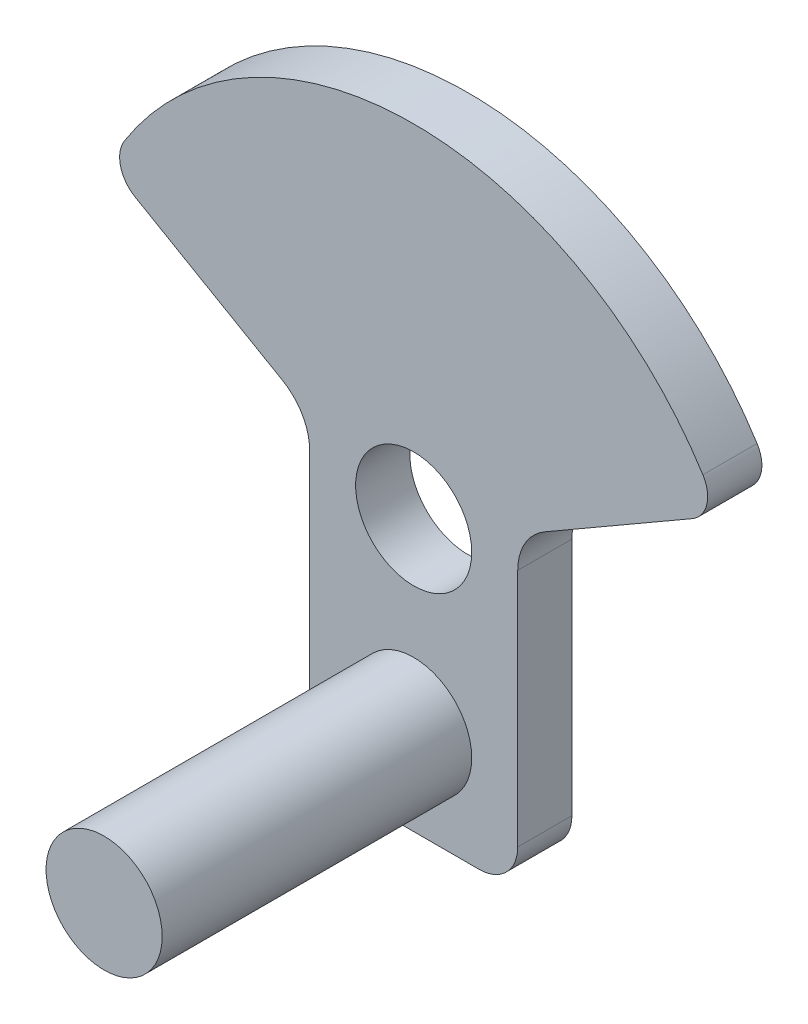
ISO-10303-21;
HEADER;
FILE_DESCRIPTION(('STEP AP214'),'2;1');
FILE_NAME('part.step','',(''),(''),'','','');
FILE_SCHEMA(('AUTOMOTIVE_DESIGN { 1 0 10303 214 1 1 1 1 }'));
ENDSEC;
DATA;
#1=APPLICATION_CONTEXT('core data for automotive mechanical design processes');
#2=APPLICATION_PROTOCOL_DEFINITION('international standard','automotive_design',2000,#1);
#3=PRODUCT_CONTEXT('',#1,'mechanical');
#4=PRODUCT('Part','Part','',(#3));
#5=PRODUCT_RELATED_PRODUCT_CATEGORY('part','',(#4));
#6=PRODUCT_DEFINITION_FORMATION('','',#4);
#7=PRODUCT_DEFINITION_CONTEXT('part definition',#1,'design');
#8=PRODUCT_DEFINITION('design','',#6,#7);
#9=PRODUCT_DEFINITION_SHAPE('','',#8);
#10=(LENGTH_UNIT() NAMED_UNIT(*) SI_UNIT(.MILLI.,.METRE.));
#11=(NAMED_UNIT(*) PLANE_ANGLE_UNIT() SI_UNIT($,.RADIAN.));
#12=(NAMED_UNIT(*) SI_UNIT($,.STERADIAN.) SOLID_ANGLE_UNIT());
#13=UNCERTAINTY_MEASURE_WITH_UNIT(LENGTH_MEASURE(1.E-05),#10,'distance_accuracy_value','');
#14=(GEOMETRIC_REPRESENTATION_CONTEXT(3) GLOBAL_UNCERTAINTY_ASSIGNED_CONTEXT((#13)) GLOBAL_UNIT_ASSIGNED_CONTEXT((#10,
#11,#12)) REPRESENTATION_CONTEXT('',''));
#15=CARTESIAN_POINT('',(0.,0.,0.));
#16=DIRECTION('',(0.,0.,1.));
#17=DIRECTION('',(1.,0.,0.));
#18=AXIS2_PLACEMENT_3D('',#15,#16,#17);
#19=CARTESIAN_POINT('',(33.8951098397121,35.9585481156726,7.));
#20=DIRECTION('',(0.,0.,1.));
#21=DIRECTION('',(1.,0.,0.));
#22=AXIS2_PLACEMENT_3D('',#19,#20,#21);
#23=PLANE('',#22);
#24=CARTESIAN_POINT('',(13.447554919856,12.,7.));
#25=DIRECTION('',(0.,0.,1.));
#26=DIRECTION('',(1.,0.,0.));
#27=AXIS2_PLACEMENT_3D('',#24,#25,#26);
#28=CIRCLE('',#27,7.5);
#29=CARTESIAN_POINT('',(20.947554919856,12.,7.));
#30=VERTEX_POINT('',#29);
#31=EDGE_CURVE('E430',#30,#30,#28,.T.);
#32=ORIENTED_EDGE('',*,*,#31,.F.);
#33=EDGE_LOOP('',(#32));
#34=FACE_BOUND('',#33,.T.);
#35=CARTESIAN_POINT('',(33.8951098397121,35.9585481156726,7.));
#36=DIRECTION('',(0.,0.,1.));
#37=DIRECTION('',(1.,0.,0.));
#38=AXIS2_PLACEMENT_3D('',#35,#36,#37);
#39=CIRCLE('',#38,7.);
#40=CARTESIAN_POINT('',(30.395109839712,42.0207259421637,7.));
#41=VERTEX_POINT('',#40);
#42=CARTESIAN_POINT('',(26.8951098397121,35.9585481156727,7.));
#43=VERTEX_POINT('',#42);
#44=EDGE_CURVE('E228',#41,#43,#39,.T.);
#45=ORIENTED_EDGE('',*,*,#44,.F.);
#46=DIRECTION('',(0.866025403784435,0.500000000000006,0.));
#47=VECTOR('',#46,1.);
#48=CARTESIAN_POINT('',(30.395109839712,42.0207259421637,7.));
#49=LINE('',#48,#47);
#50=CARTESIAN_POINT('',(49.4401305831722,53.0163737951226,7.));
#51=VERTEX_POINT('',#50);
#52=EDGE_CURVE('E187',#41,#51,#49,.T.);
#53=ORIENTED_EDGE('',*,*,#52,.T.);
#54=CARTESIAN_POINT('',(47.4401305831722,56.4804754102603,7.));
#55=DIRECTION('',(0.,0.,-1.));
#56=DIRECTION('',(-1.,0.,0.));
#57=AXIS2_PLACEMENT_3D('',#54,#55,#56);
#58=CIRCLE('',#57,3.99999999999997);
#59=CARTESIAN_POINT('',(50.8215704971486,58.617263679642,7.));
#60=VERTEX_POINT('',#59);
#61=EDGE_CURVE('E175',#60,#51,#58,.T.);
#62=ORIENTED_EDGE('',*,*,#61,.F.);
#63=CARTESIAN_POINT('',(13.447554919856,35.,7.));
#64=DIRECTION('',(0.,0.,-1.));
#65=DIRECTION('',(-1.,0.,0.));
#66=AXIS2_PLACEMENT_3D('',#63,#64,#65);
#67=CIRCLE('',#66,44.2107700010467);
#68=CARTESIAN_POINT('',(-23.9264606574367,58.6172636796418,7.));
#69=VERTEX_POINT('',#68);
#70=EDGE_CURVE('E186',#69,#60,#67,.T.);
#71=ORIENTED_EDGE('',*,*,#70,.F.);
#72=CARTESIAN_POINT('',(-20.5450207434603,56.4804754102601,7.));
#73=DIRECTION('',(0.,0.,1.));
#74=DIRECTION('',(1.,0.,0.));
#75=AXIS2_PLACEMENT_3D('',#72,#73,#74);
#76=CIRCLE('',#75,4.00000000000001);
#77=CARTESIAN_POINT('',(-22.5450207434603,53.0163737951224,7.));
#78=VERTEX_POINT('',#77);
#79=EDGE_CURVE('E191',#69,#78,#76,.T.);
#80=ORIENTED_EDGE('',*,*,#79,.T.);
#81=DIRECTION('',(-0.86602540378444,0.499999999999998,0.));
#82=VECTOR('',#81,1.);
#83=CARTESIAN_POINT('',(-3.50000000000002,42.0207259421637,7.));
#84=LINE('',#83,#82);
#85=CARTESIAN_POINT('',(-3.50000000000002,42.0207259421637,7.));
#86=VERTEX_POINT('',#85);
#87=EDGE_CURVE('E193',#86,#78,#84,.T.);
#88=ORIENTED_EDGE('',*,*,#87,.F.);
#89=CARTESIAN_POINT('',(-7.,35.9585481156726,7.));
#90=DIRECTION('',(0.,0.,1.));
#91=DIRECTION('',(1.,0.,0.));
#92=AXIS2_PLACEMENT_3D('',#89,#90,#91);
#93=CIRCLE('',#92,7.);
#94=CARTESIAN_POINT('',(0.,35.9585481156726,7.));
#95=VERTEX_POINT('',#94);
#96=EDGE_CURVE('E271',#95,#86,#93,.T.);
#97=ORIENTED_EDGE('',*,*,#96,.F.);
#98=DIRECTION('',(0.,1.,0.));
#99=VECTOR('',#98,1.);
#100=CARTESIAN_POINT('',(0.,5.00000000000004,7.));
#101=LINE('',#100,#99);
#102=CARTESIAN_POINT('',(0.,5.00000000000004,7.));
#103=VERTEX_POINT('',#102);
#104=EDGE_CURVE('E268',#103,#95,#101,.T.);
#105=ORIENTED_EDGE('',*,*,#104,.F.);
#106=CARTESIAN_POINT('',(5.,5.,7.));
#107=DIRECTION('',(0.,0.,-1.));
#108=DIRECTION('',(-1.,0.,0.));
#109=AXIS2_PLACEMENT_3D('',#106,#107,#108);
#110=CIRCLE('',#109,5.);
#111=CARTESIAN_POINT('',(5.00000000000004,0.,7.));
#112=VERTEX_POINT('',#111);
#113=EDGE_CURVE('E265',#112,#103,#110,.T.);
#114=ORIENTED_EDGE('',*,*,#113,.F.);
#115=DIRECTION('',(1.,0.,0.));
#116=VECTOR('',#115,1.);
#117=CARTESIAN_POINT('',(5.00000000000004,0.,7.));
#118=LINE('',#117,#116);
#119=CARTESIAN_POINT('',(21.895109839712,0.,7.));
#120=VERTEX_POINT('',#119);
#121=EDGE_CURVE('E263',#112,#120,#118,.T.);
#122=ORIENTED_EDGE('',*,*,#121,.T.);
#123=CARTESIAN_POINT('',(21.8951098397121,5.,7.));
#124=DIRECTION('',(0.,0.,1.));
#125=DIRECTION('',(1.,0.,0.));
#126=AXIS2_PLACEMENT_3D('',#123,#124,#125);
#127=CIRCLE('',#126,5.);
#128=CARTESIAN_POINT('',(26.8951098397121,5.,7.));
#129=VERTEX_POINT('',#128);
#130=EDGE_CURVE('E256',#120,#129,#127,.T.);
#131=ORIENTED_EDGE('',*,*,#130,.T.);
#132=DIRECTION('',(0.,1.,0.));
#133=VECTOR('',#132,1.);
#134=CARTESIAN_POINT('',(26.8951098397121,5.00000000000004,7.));
#135=LINE('',#134,#133);
#136=EDGE_CURVE('E147',#129,#43,#135,.T.);
#137=ORIENTED_EDGE('',*,*,#136,.T.);
#138=EDGE_LOOP('',(#45,#53,#62,#71,#80,#88,#97,#105,#114,#122,#131,#137));
#139=FACE_BOUND('',#138,.T.);
#140=CARTESIAN_POINT('',(13.447554919856,35.,7.));
#141=DIRECTION('',(0.,0.,1.));
#142=DIRECTION('',(1.,0.,0.));
#143=AXIS2_PLACEMENT_3D('',#140,#141,#142);
#144=CIRCLE('',#143,7.50000000000001);
#145=CARTESIAN_POINT('',(20.947554919856,35.,7.));
#146=VERTEX_POINT('',#145);
#147=EDGE_CURVE('E202',#146,#146,#144,.T.);
#148=ORIENTED_EDGE('',*,*,#147,.F.);
#149=EDGE_LOOP('',(#148));
#150=FACE_BOUND('',#149,.T.);
#151=ADVANCED_FACE('F77',(#34,#139,#150),#23,.T.);
#152=CARTESIAN_POINT('',(33.8951098397121,35.9585481156726,0.));
#153=DIRECTION('',(0.,0.,1.));
#154=DIRECTION('',(1.,0.,0.));
#155=AXIS2_PLACEMENT_3D('',#152,#153,#154);
#156=PLANE('',#155);
#157=CARTESIAN_POINT('',(33.8951098397121,35.9585481156726,0.));
#158=DIRECTION('',(0.,0.,1.));
#159=DIRECTION('',(1.,0.,0.));
#160=AXIS2_PLACEMENT_3D('',#157,#158,#159);
#161=CIRCLE('',#160,7.);
#162=CARTESIAN_POINT('',(30.395109839712,42.0207259421637,0.));
#163=VERTEX_POINT('',#162);
#164=CARTESIAN_POINT('',(26.8951098397121,35.9585481156727,0.));
#165=VERTEX_POINT('',#164);
#166=EDGE_CURVE('E198',#163,#165,#161,.T.);
#167=ORIENTED_EDGE('',*,*,#166,.T.);
#168=DIRECTION('',(0.,1.,0.));
#169=VECTOR('',#168,1.);
#170=CARTESIAN_POINT('',(26.8951098397121,5.00000000000004,0.));
#171=LINE('',#170,#169);
#172=CARTESIAN_POINT('',(26.8951098397121,5.,0.));
#173=VERTEX_POINT('',#172);
#174=EDGE_CURVE('E201',#173,#165,#171,.T.);
#175=ORIENTED_EDGE('',*,*,#174,.F.);
#176=CARTESIAN_POINT('',(21.8951098397121,5.,0.));
#177=DIRECTION('',(0.,0.,1.));
#178=DIRECTION('',(1.,0.,0.));
#179=AXIS2_PLACEMENT_3D('',#176,#177,#178);
#180=CIRCLE('',#179,5.);
#181=CARTESIAN_POINT('',(21.895109839712,0.,0.));
#182=VERTEX_POINT('',#181);
#183=EDGE_CURVE('E205',#182,#173,#180,.T.);
#184=ORIENTED_EDGE('',*,*,#183,.F.);
#185=DIRECTION('',(1.,0.,0.));
#186=VECTOR('',#185,1.);
#187=CARTESIAN_POINT('',(5.00000000000004,0.,0.));
#188=LINE('',#187,#186);
#189=CARTESIAN_POINT('',(5.00000000000004,0.,0.));
#190=VERTEX_POINT('',#189);
#191=EDGE_CURVE('E207',#190,#182,#188,.T.);
#192=ORIENTED_EDGE('',*,*,#191,.F.);
#193=CARTESIAN_POINT('',(5.,5.,0.));
#194=DIRECTION('',(0.,0.,-1.));
#195=DIRECTION('',(-1.,0.,0.));
#196=AXIS2_PLACEMENT_3D('',#193,#194,#195);
#197=CIRCLE('',#196,5.);
#198=CARTESIAN_POINT('',(0.,5.00000000000004,0.));
#199=VERTEX_POINT('',#198);
#200=EDGE_CURVE('E209',#190,#199,#197,.T.);
#201=ORIENTED_EDGE('',*,*,#200,.T.);
#202=DIRECTION('',(0.,1.,0.));
#203=VECTOR('',#202,1.);
#204=CARTESIAN_POINT('',(0.,5.00000000000004,0.));
#205=LINE('',#204,#203);
#206=CARTESIAN_POINT('',(0.,35.9585481156726,0.));
#207=VERTEX_POINT('',#206);
#208=EDGE_CURVE('E212',#199,#207,#205,.T.);
#209=ORIENTED_EDGE('',*,*,#208,.T.);
#210=CARTESIAN_POINT('',(-7.,35.9585481156726,0.));
#211=DIRECTION('',(0.,0.,1.));
#212=DIRECTION('',(1.,0.,0.));
#213=AXIS2_PLACEMENT_3D('',#210,#211,#212);
#214=CIRCLE('',#213,7.);
#215=CARTESIAN_POINT('',(-3.50000000000002,42.0207259421637,0.));
#216=VERTEX_POINT('',#215);
#217=EDGE_CURVE('E215',#207,#216,#214,.T.);
#218=ORIENTED_EDGE('',*,*,#217,.T.);
#219=DIRECTION('',(-0.86602540378444,0.499999999999998,0.));
#220=VECTOR('',#219,1.);
#221=CARTESIAN_POINT('',(-3.50000000000002,42.0207259421637,0.));
#222=LINE('',#221,#220);
#223=CARTESIAN_POINT('',(-22.5450207434603,53.0163737951224,0.));
#224=VERTEX_POINT('',#223);
#225=EDGE_CURVE('E218',#216,#224,#222,.T.);
#226=ORIENTED_EDGE('',*,*,#225,.T.);
#227=CARTESIAN_POINT('',(-20.5450207434603,56.4804754102601,0.));
#228=DIRECTION('',(0.,0.,1.));
#229=DIRECTION('',(1.,0.,0.));
#230=AXIS2_PLACEMENT_3D('',#227,#228,#229);
#231=CIRCLE('',#230,4.00000000000001);
#232=CARTESIAN_POINT('',(-23.9264606574367,58.6172636796418,0.));
#233=VERTEX_POINT('',#232);
#234=EDGE_CURVE('E221',#233,#224,#231,.T.);
#235=ORIENTED_EDGE('',*,*,#234,.F.);
#236=CARTESIAN_POINT('',(13.447554919856,35.,0.));
#237=DIRECTION('',(0.,0.,-1.));
#238=DIRECTION('',(-1.,0.,0.));
#239=AXIS2_PLACEMENT_3D('',#236,#237,#238);
#240=CIRCLE('',#239,44.2107700010467);
#241=CARTESIAN_POINT('',(50.8215704971486,58.617263679642,0.));
#242=VERTEX_POINT('',#241);
#243=EDGE_CURVE('E224',#233,#242,#240,.T.);
#244=ORIENTED_EDGE('',*,*,#243,.T.);
#245=CARTESIAN_POINT('',(47.4401305831722,56.4804754102603,0.));
#246=DIRECTION('',(0.,0.,-1.));
#247=DIRECTION('',(-1.,0.,0.));
#248=AXIS2_PLACEMENT_3D('',#245,#246,#247);
#249=CIRCLE('',#248,3.99999999999997);
#250=CARTESIAN_POINT('',(49.4401305831722,53.0163737951226,0.));
#251=VERTEX_POINT('',#250);
#252=EDGE_CURVE('E177',#242,#251,#249,.T.);
#253=ORIENTED_EDGE('',*,*,#252,.T.);
#254=DIRECTION('',(0.866025403784435,0.500000000000006,0.));
#255=VECTOR('',#254,1.);
#256=CARTESIAN_POINT('',(30.395109839712,42.0207259421637,0.));
#257=LINE('',#256,#255);
#258=EDGE_CURVE('E227',#163,#251,#257,.T.);
#259=ORIENTED_EDGE('',*,*,#258,.F.);
#260=EDGE_LOOP('',(#167,#175,#184,#192,#201,#209,#218,#226,#235,#244,#253,#259));
#261=FACE_BOUND('',#260,.T.);
#262=CARTESIAN_POINT('',(13.447554919856,35.,0.));
#263=DIRECTION('',(0.,0.,1.));
#264=DIRECTION('',(1.,0.,0.));
#265=AXIS2_PLACEMENT_3D('',#262,#263,#264);
#266=CIRCLE('',#265,7.50000000000001);
#267=CARTESIAN_POINT('',(20.947554919856,35.,0.));
#268=VERTEX_POINT('',#267);
#269=EDGE_CURVE('E259',#268,#268,#266,.T.);
#270=ORIENTED_EDGE('',*,*,#269,.T.);
#271=EDGE_LOOP('',(#270));
#272=FACE_BOUND('',#271,.T.);
#273=ADVANCED_FACE('F252',(#261,#272),#156,.F.);
#274=CARTESIAN_POINT('',(33.8951098397121,35.9585481156726,7.));
#275=DIRECTION('',(0.,0.,-1.));
#276=DIRECTION('',(-1.,0.,0.));
#277=AXIS2_PLACEMENT_3D('',#274,#275,#276);
#278=CYLINDRICAL_SURFACE('',#277,7.);
#279=ORIENTED_EDGE('',*,*,#166,.F.);
#280=DIRECTION('',(0.,0.,-1.));
#281=VECTOR('',#280,1.);
#282=CARTESIAN_POINT('',(30.395109839712,42.0207259421637,7.));
#283=LINE('',#282,#281);
#284=EDGE_CURVE('E12',#41,#163,#283,.T.);
#285=ORIENTED_EDGE('',*,*,#284,.F.);
#286=ORIENTED_EDGE('',*,*,#44,.T.);
#287=DIRECTION('',(0.,0.,-1.));
#288=VECTOR('',#287,1.);
#289=CARTESIAN_POINT('',(26.8951098397121,35.9585481156727,7.));
#290=LINE('',#289,#288);
#291=EDGE_CURVE('E81',#43,#165,#290,.T.);
#292=ORIENTED_EDGE('',*,*,#291,.T.);
#293=EDGE_LOOP('',(#279,#285,#286,#292));
#294=FACE_BOUND('',#293,.T.);
#295=ADVANCED_FACE('F79',(#294),#278,.F.);
#296=CARTESIAN_POINT('',(30.395109839712,42.0207259421637,7.));
#297=DIRECTION('',(-0.500000000000006,0.866025403784435,0.));
#298=DIRECTION('',(-0.866025403784435,-0.500000000000006,0.));
#299=AXIS2_PLACEMENT_3D('',#296,#297,#298);
#300=PLANE('',#299);
#301=ORIENTED_EDGE('',*,*,#258,.T.);
#302=DIRECTION('',(0.,0.,-1.));
#303=VECTOR('',#302,1.);
#304=CARTESIAN_POINT('',(49.4401305831722,53.0163737951226,7.));
#305=LINE('',#304,#303);
#306=EDGE_CURVE('E87',#51,#251,#305,.T.);
#307=ORIENTED_EDGE('',*,*,#306,.F.);
#308=ORIENTED_EDGE('',*,*,#52,.F.);
#309=ORIENTED_EDGE('',*,*,#284,.T.);
#310=EDGE_LOOP('',(#301,#307,#308,#309));
#311=FACE_BOUND('',#310,.T.);
#312=ADVANCED_FACE('F254',(#311),#300,.F.);
#313=CARTESIAN_POINT('',(47.4401305831722,56.4804754102603,7.));
#314=DIRECTION('',(0.,0.,-1.));
#315=DIRECTION('',(-1.,0.,0.));
#316=AXIS2_PLACEMENT_3D('',#313,#314,#315);
#317=CYLINDRICAL_SURFACE('',#316,3.99999999999997);
#318=ORIENTED_EDGE('',*,*,#252,.F.);
#319=DIRECTION('',(0.,0.,-1.));
#320=VECTOR('',#319,1.);
#321=CARTESIAN_POINT('',(50.8215704971486,58.617263679642,7.));
#322=LINE('',#321,#320);
#323=EDGE_CURVE('E172',#60,#242,#322,.T.);
#324=ORIENTED_EDGE('',*,*,#323,.F.);
#325=ORIENTED_EDGE('',*,*,#61,.T.);
#326=ORIENTED_EDGE('',*,*,#306,.T.);
#327=EDGE_LOOP('',(#318,#324,#325,#326));
#328=FACE_BOUND('',#327,.T.);
#329=ADVANCED_FACE('F174',(#328),#317,.T.);
#330=CARTESIAN_POINT('',(13.447554919856,35.,7.));
#331=DIRECTION('',(0.,0.,-1.));
#332=DIRECTION('',(-1.,0.,0.));
#333=AXIS2_PLACEMENT_3D('',#330,#331,#332);
#334=CYLINDRICAL_SURFACE('',#333,44.2107700010467);
#335=ORIENTED_EDGE('',*,*,#243,.F.);
#336=DIRECTION('',(0.,0.,-1.));
#337=VECTOR('',#336,1.);
#338=CARTESIAN_POINT('',(-23.9264606574367,58.6172636796418,7.));
#339=LINE('',#338,#337);
#340=EDGE_CURVE('E182',#69,#233,#339,.T.);
#341=ORIENTED_EDGE('',*,*,#340,.F.);
#342=ORIENTED_EDGE('',*,*,#70,.T.);
#343=ORIENTED_EDGE('',*,*,#323,.T.);
#344=EDGE_LOOP('',(#335,#341,#342,#343));
#345=FACE_BOUND('',#344,.T.);
#346=ADVANCED_FACE('F189',(#345),#334,.T.);
#347=CARTESIAN_POINT('',(-20.5450207434603,56.4804754102601,7.));
#348=DIRECTION('',(0.,0.,-1.));
#349=DIRECTION('',(-1.,0.,0.));
#350=AXIS2_PLACEMENT_3D('',#347,#348,#349);
#351=CYLINDRICAL_SURFACE('',#350,4.00000000000001);
#352=ORIENTED_EDGE('',*,*,#234,.T.);
#353=DIRECTION('',(0.,0.,-1.));
#354=VECTOR('',#353,1.);
#355=CARTESIAN_POINT('',(-22.5450207434603,53.0163737951224,7.));
#356=LINE('',#355,#354);
#357=EDGE_CURVE('E232',#78,#224,#356,.T.);
#358=ORIENTED_EDGE('',*,*,#357,.F.);
#359=ORIENTED_EDGE('',*,*,#79,.F.);
#360=ORIENTED_EDGE('',*,*,#340,.T.);
#361=EDGE_LOOP('',(#352,#358,#359,#360));
#362=FACE_BOUND('',#361,.T.);
#363=ADVANCED_FACE('F301',(#362),#351,.T.);
#364=CARTESIAN_POINT('',(-3.50000000000002,42.0207259421637,7.));
#365=DIRECTION('',(-0.499999999999998,-0.86602540378444,0.));
#366=DIRECTION('',(0.86602540378444,-0.499999999999998,0.));
#367=AXIS2_PLACEMENT_3D('',#364,#365,#366);
#368=PLANE('',#367);
#369=ORIENTED_EDGE('',*,*,#225,.F.);
#370=DIRECTION('',(0.,0.,-1.));
#371=VECTOR('',#370,1.);
#372=CARTESIAN_POINT('',(-3.50000000000002,42.0207259421637,7.));
#373=LINE('',#372,#371);
#374=EDGE_CURVE('E234',#86,#216,#373,.T.);
#375=ORIENTED_EDGE('',*,*,#374,.F.);
#376=ORIENTED_EDGE('',*,*,#87,.T.);
#377=ORIENTED_EDGE('',*,*,#357,.T.);
#378=EDGE_LOOP('',(#369,#375,#376,#377));
#379=FACE_BOUND('',#378,.T.);
#380=ADVANCED_FACE('F277',(#379),#368,.T.);
#381=CARTESIAN_POINT('',(-7.,35.9585481156726,7.));
#382=DIRECTION('',(0.,0.,-1.));
#383=DIRECTION('',(-1.,0.,0.));
#384=AXIS2_PLACEMENT_3D('',#381,#382,#383);
#385=CYLINDRICAL_SURFACE('',#384,7.);
#386=ORIENTED_EDGE('',*,*,#217,.F.);
#387=DIRECTION('',(0.,0.,-1.));
#388=VECTOR('',#387,1.);
#389=CARTESIAN_POINT('',(0.,35.9585481156726,7.));
#390=LINE('',#389,#388);
#391=EDGE_CURVE('E236',#95,#207,#390,.T.);
#392=ORIENTED_EDGE('',*,*,#391,.F.);
#393=ORIENTED_EDGE('',*,*,#96,.T.);
#394=ORIENTED_EDGE('',*,*,#374,.T.);
#395=EDGE_LOOP('',(#386,#392,#393,#394));
#396=FACE_BOUND('',#395,.T.);
#397=ADVANCED_FACE('F283',(#396),#385,.F.);
#398=CARTESIAN_POINT('',(0.,5.00000000000004,7.));
#399=DIRECTION('',(-1.,0.,0.));
#400=DIRECTION('',(0.,0.,1.));
#401=AXIS2_PLACEMENT_3D('',#398,#399,#400);
#402=PLANE('',#401);
#403=ORIENTED_EDGE('',*,*,#208,.F.);
#404=DIRECTION('',(0.,0.,-1.));
#405=VECTOR('',#404,1.);
#406=CARTESIAN_POINT('',(0.,5.00000000000004,7.));
#407=LINE('',#406,#405);
#408=EDGE_CURVE('E238',#103,#199,#407,.T.);
#409=ORIENTED_EDGE('',*,*,#408,.F.);
#410=ORIENTED_EDGE('',*,*,#104,.T.);
#411=ORIENTED_EDGE('',*,*,#391,.T.);
#412=EDGE_LOOP('',(#403,#409,#410,#411));
#413=FACE_BOUND('',#412,.T.);
#414=ADVANCED_FACE('F286',(#413),#402,.T.);
#415=CARTESIAN_POINT('',(5.,5.,7.));
#416=DIRECTION('',(0.,0.,-1.));
#417=DIRECTION('',(-1.,0.,0.));
#418=AXIS2_PLACEMENT_3D('',#415,#416,#417);
#419=CYLINDRICAL_SURFACE('',#418,5.);
#420=ORIENTED_EDGE('',*,*,#200,.F.);
#421=DIRECTION('',(0.,0.,-1.));
#422=VECTOR('',#421,1.);
#423=CARTESIAN_POINT('',(5.00000000000004,0.,7.));
#424=LINE('',#423,#422);
#425=EDGE_CURVE('E240',#112,#190,#424,.T.);
#426=ORIENTED_EDGE('',*,*,#425,.F.);
#427=ORIENTED_EDGE('',*,*,#113,.T.);
#428=ORIENTED_EDGE('',*,*,#408,.T.);
#429=EDGE_LOOP('',(#420,#426,#427,#428));
#430=FACE_BOUND('',#429,.T.);
#431=ADVANCED_FACE('F290',(#430),#419,.T.);
#432=CARTESIAN_POINT('',(5.00000000000004,0.,7.));
#433=DIRECTION('',(0.,1.,0.));
#434=DIRECTION('',(0.,0.,1.));
#435=AXIS2_PLACEMENT_3D('',#432,#433,#434);
#436=PLANE('',#435);
#437=ORIENTED_EDGE('',*,*,#191,.T.);
#438=DIRECTION('',(0.,0.,-1.));
#439=VECTOR('',#438,1.);
#440=CARTESIAN_POINT('',(21.895109839712,0.,7.));
#441=LINE('',#440,#439);
#442=EDGE_CURVE('E242',#120,#182,#441,.T.);
#443=ORIENTED_EDGE('',*,*,#442,.F.);
#444=ORIENTED_EDGE('',*,*,#121,.F.);
#445=ORIENTED_EDGE('',*,*,#425,.T.);
#446=EDGE_LOOP('',(#437,#443,#444,#445));
#447=FACE_BOUND('',#446,.T.);
#448=ADVANCED_FACE('F295',(#447),#436,.F.);
#449=CARTESIAN_POINT('',(21.8951098397121,5.,7.));
#450=DIRECTION('',(0.,0.,-1.));
#451=DIRECTION('',(-1.,0.,0.));
#452=AXIS2_PLACEMENT_3D('',#449,#450,#451);
#453=CYLINDRICAL_SURFACE('',#452,5.);
#454=ORIENTED_EDGE('',*,*,#183,.T.);
#455=DIRECTION('',(0.,0.,-1.));
#456=VECTOR('',#455,1.);
#457=CARTESIAN_POINT('',(26.8951098397121,5.,7.));
#458=LINE('',#457,#456);
#459=EDGE_CURVE('E244',#129,#173,#458,.T.);
#460=ORIENTED_EDGE('',*,*,#459,.F.);
#461=ORIENTED_EDGE('',*,*,#130,.F.);
#462=ORIENTED_EDGE('',*,*,#442,.T.);
#463=EDGE_LOOP('',(#454,#460,#461,#462));
#464=FACE_BOUND('',#463,.T.);
#465=ADVANCED_FACE('F298',(#464),#453,.T.);
#466=CARTESIAN_POINT('',(26.8951098397121,5.00000000000004,7.));
#467=DIRECTION('',(-1.,0.,0.));
#468=DIRECTION('',(0.,0.,1.));
#469=AXIS2_PLACEMENT_3D('',#466,#467,#468);
#470=PLANE('',#469);
#471=ORIENTED_EDGE('',*,*,#174,.T.);
#472=ORIENTED_EDGE('',*,*,#291,.F.);
#473=ORIENTED_EDGE('',*,*,#136,.F.);
#474=ORIENTED_EDGE('',*,*,#459,.T.);
#475=EDGE_LOOP('',(#471,#472,#473,#474));
#476=FACE_BOUND('',#475,.T.);
#477=ADVANCED_FACE('F249',(#476),#470,.F.);
#478=CARTESIAN_POINT('',(13.447554919856,35.,7.));
#479=DIRECTION('',(0.,0.,-1.));
#480=DIRECTION('',(-1.,0.,0.));
#481=AXIS2_PLACEMENT_3D('',#478,#479,#480);
#482=CYLINDRICAL_SURFACE('',#481,7.50000000000001);
#483=ORIENTED_EDGE('',*,*,#147,.T.);
#484=EDGE_LOOP('',(#483));
#485=FACE_BOUND('',#484,.T.);
#486=ORIENTED_EDGE('',*,*,#269,.F.);
#487=EDGE_LOOP('',(#486));
#488=FACE_BOUND('',#487,.T.);
#489=ADVANCED_FACE('F319',(#485,#488),#482,.F.);
#490=CARTESIAN_POINT('',(13.447554919856,12.,47.));
#491=DIRECTION('',(0.,0.,-1.));
#492=DIRECTION('',(-1.,0.,0.));
#493=AXIS2_PLACEMENT_3D('',#490,#491,#492);
#494=CYLINDRICAL_SURFACE('',#493,7.5);
#495=CARTESIAN_POINT('',(13.447554919856,12.,47.));
#496=DIRECTION('',(0.,0.,1.));
#497=DIRECTION('',(1.,0.,0.));
#498=AXIS2_PLACEMENT_3D('',#495,#496,#497);
#499=CIRCLE('',#498,7.5);
#500=CARTESIAN_POINT('',(20.947554919856,12.,47.));
#501=VERTEX_POINT('',#500);
#502=EDGE_CURVE('E429',#501,#501,#499,.T.);
#503=ORIENTED_EDGE('',*,*,#502,.F.);
#504=EDGE_LOOP('',(#503));
#505=FACE_BOUND('',#504,.T.);
#506=ORIENTED_EDGE('',*,*,#31,.T.);
#507=EDGE_LOOP('',(#506));
#508=FACE_BOUND('',#507,.T.);
#509=ADVANCED_FACE('F399',(#505,#508),#494,.T.);
#510=CARTESIAN_POINT('',(13.447554919856,12.,47.));
#511=DIRECTION('',(0.,0.,1.));
#512=DIRECTION('',(1.,0.,0.));
#513=AXIS2_PLACEMENT_3D('',#510,#511,#512);
#514=PLANE('',#513);
#515=ORIENTED_EDGE('',*,*,#502,.T.);
#516=EDGE_LOOP('',(#515));
#517=FACE_BOUND('',#516,.T.);
#518=ADVANCED_FACE('F414',(#517),#514,.T.);
#519=CLOSED_SHELL('',(#151,#273,#295,#312,#329,#346,#363,#380,#397,#414,#431,#448,#465,#477,
#489,#509,#518));
#520=MANIFOLD_SOLID_BREP('B2',#519);
#521=ADVANCED_BREP_SHAPE_REPRESENTATION('',(#18,#520),#14);
#522=SHAPE_DEFINITION_REPRESENTATION(#9,#521);
ENDSEC;
END-ISO-10303-21;
